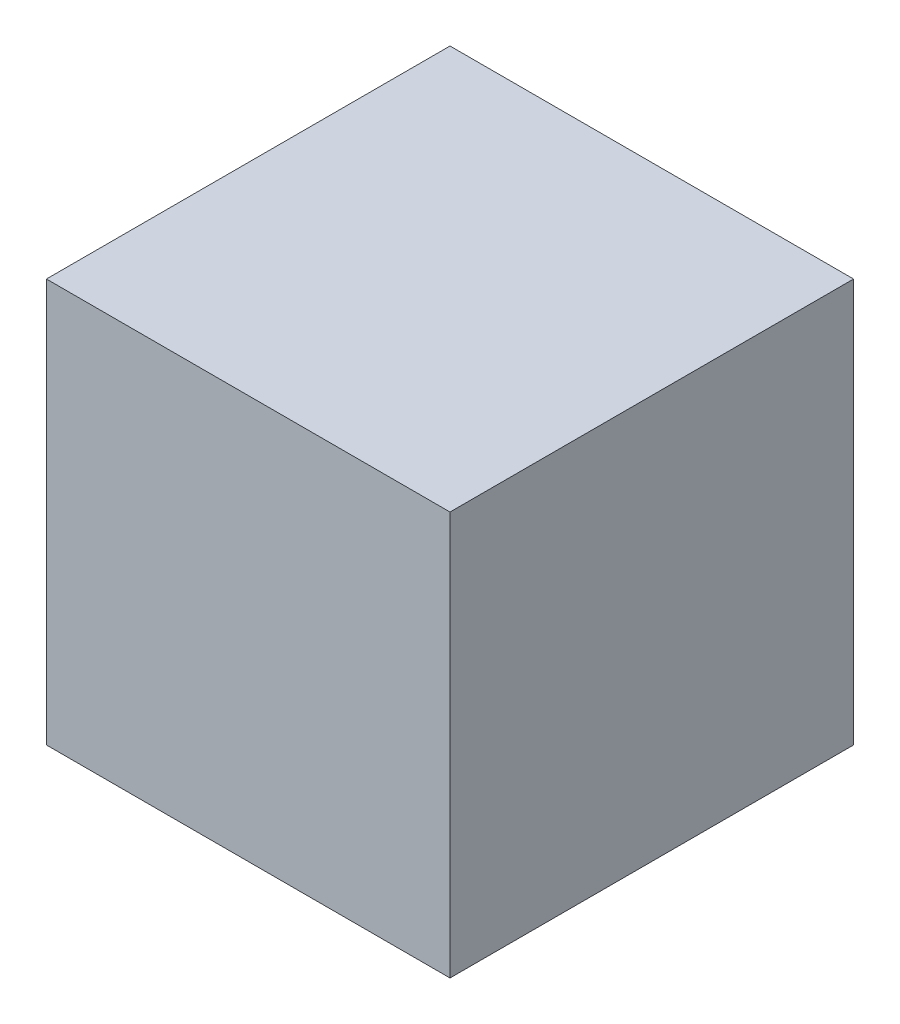
ISO-10303-21;
HEADER;
FILE_DESCRIPTION(('STEP AP214'),'2;1');
FILE_NAME('part.step','',(''),(''),'','','');
FILE_SCHEMA(('AUTOMOTIVE_DESIGN { 1 0 10303 214 1 1 1 1 }'));
ENDSEC;
DATA;
#1=APPLICATION_CONTEXT('core data for automotive mechanical design processes');
#2=APPLICATION_PROTOCOL_DEFINITION('international standard','automotive_design',2000,#1);
#3=PRODUCT_CONTEXT('',#1,'mechanical');
#4=PRODUCT('Part','Part','',(#3));
#5=PRODUCT_RELATED_PRODUCT_CATEGORY('part','',(#4));
#6=PRODUCT_DEFINITION_FORMATION('','',#4);
#7=PRODUCT_DEFINITION_CONTEXT('part definition',#1,'design');
#8=PRODUCT_DEFINITION('design','',#6,#7);
#9=PRODUCT_DEFINITION_SHAPE('','',#8);
#10=(LENGTH_UNIT() NAMED_UNIT(*) SI_UNIT(.MILLI.,.METRE.));
#11=(NAMED_UNIT(*) PLANE_ANGLE_UNIT() SI_UNIT($,.RADIAN.));
#12=(NAMED_UNIT(*) SI_UNIT($,.STERADIAN.) SOLID_ANGLE_UNIT());
#13=UNCERTAINTY_MEASURE_WITH_UNIT(LENGTH_MEASURE(1.E-05),#10,'distance_accuracy_value','');
#14=(GEOMETRIC_REPRESENTATION_CONTEXT(3) GLOBAL_UNCERTAINTY_ASSIGNED_CONTEXT((#13)) GLOBAL_UNIT_ASSIGNED_CONTEXT((#10,
#11,#12)) REPRESENTATION_CONTEXT('',''));
#15=CARTESIAN_POINT('',(0.,0.,0.));
#16=DIRECTION('',(0.,0.,1.));
#17=DIRECTION('',(1.,0.,0.));
#18=AXIS2_PLACEMENT_3D('',#15,#16,#17);
#19=CARTESIAN_POINT('',(-0.500000000000001,-0.500000000000001,0.));
#20=DIRECTION('',(0.,0.,1.));
#21=DIRECTION('',(1.,0.,0.));
#22=AXIS2_PLACEMENT_3D('',#19,#20,#21);
#23=PLANE('',#22);
#24=DIRECTION('',(1.,0.,0.));
#25=VECTOR('',#24,1.);
#26=CARTESIAN_POINT('',(-0.500000000000001,0.500000000000001,0.));
#27=LINE('',#26,#25);
#28=CARTESIAN_POINT('',(-0.500000000000001,0.500000000000001,0.));
#29=VERTEX_POINT('',#28);
#30=CARTESIAN_POINT('',(0.500000000000001,0.500000000000001,0.));
#31=VERTEX_POINT('',#30);
#32=EDGE_CURVE('E81',#29,#31,#27,.T.);
#33=ORIENTED_EDGE('',*,*,#32,.T.);
#34=DIRECTION('',(0.,1.,0.));
#35=VECTOR('',#34,1.);
#36=CARTESIAN_POINT('',(0.500000000000001,0.500000000000001,0.));
#37=LINE('',#36,#35);
#38=CARTESIAN_POINT('',(0.500000000000001,-0.500000000000001,0.));
#39=VERTEX_POINT('',#38);
#40=EDGE_CURVE('E68',#31,#39,#37,.F.);
#41=ORIENTED_EDGE('',*,*,#40,.T.);
#42=DIRECTION('',(1.,0.,0.));
#43=VECTOR('',#42,1.);
#44=CARTESIAN_POINT('',(-0.500000000000001,-0.500000000000001,0.));
#45=LINE('',#44,#43);
#46=CARTESIAN_POINT('',(-0.500000000000001,-0.500000000000001,0.));
#47=VERTEX_POINT('',#46);
#48=EDGE_CURVE('E55',#39,#47,#45,.F.);
#49=ORIENTED_EDGE('',*,*,#48,.T.);
#50=DIRECTION('',(0.,1.,0.));
#51=VECTOR('',#50,1.);
#52=CARTESIAN_POINT('',(-0.500000000000001,0.500000000000001,0.));
#53=LINE('',#52,#51);
#54=EDGE_CURVE('E20',#47,#29,#53,.T.);
#55=ORIENTED_EDGE('',*,*,#54,.T.);
#56=EDGE_LOOP('',(#33,#41,#49,#55));
#57=FACE_BOUND('',#56,.T.);
#58=ADVANCED_FACE('F17',(#57),#23,.F.);
#59=CARTESIAN_POINT('',(-0.500000000000001,0.500000000000001,1.));
#60=DIRECTION('',(1.,0.,0.));
#61=DIRECTION('',(0.,0.,-1.));
#62=AXIS2_PLACEMENT_3D('',#59,#60,#61);
#63=PLANE('',#62);
#64=DIRECTION('',(0.,0.,1.));
#65=VECTOR('',#64,1.);
#66=CARTESIAN_POINT('',(-0.500000000000001,-0.500000000000001,1.));
#67=LINE('',#66,#65);
#68=CARTESIAN_POINT('',(-0.500000000000001,-0.500000000000001,1.));
#69=VERTEX_POINT('',#68);
#70=EDGE_CURVE('E61',#47,#69,#67,.T.);
#71=ORIENTED_EDGE('',*,*,#70,.T.);
#72=DIRECTION('',(0.,1.,0.));
#73=VECTOR('',#72,1.);
#74=CARTESIAN_POINT('',(-0.500000000000001,-0.500000000000001,1.));
#75=LINE('',#74,#73);
#76=CARTESIAN_POINT('',(-0.500000000000001,0.500000000000001,1.));
#77=VERTEX_POINT('',#76);
#78=EDGE_CURVE('E83',#77,#69,#75,.F.);
#79=ORIENTED_EDGE('',*,*,#78,.F.);
#80=DIRECTION('',(0.,0.,-1.));
#81=VECTOR('',#80,1.);
#82=CARTESIAN_POINT('',(-0.500000000000001,0.500000000000001,1.));
#83=LINE('',#82,#81);
#84=EDGE_CURVE('E64',#77,#29,#83,.T.);
#85=ORIENTED_EDGE('',*,*,#84,.T.);
#86=ORIENTED_EDGE('',*,*,#54,.F.);
#87=EDGE_LOOP('',(#71,#79,#85,#86));
#88=FACE_BOUND('',#87,.T.);
#89=ADVANCED_FACE('F60',(#88),#63,.F.);
#90=CARTESIAN_POINT('',(-0.500000000000001,-0.500000000000001,1.));
#91=DIRECTION('',(0.,1.,0.));
#92=DIRECTION('',(0.,0.,1.));
#93=AXIS2_PLACEMENT_3D('',#90,#91,#92);
#94=PLANE('',#93);
#95=DIRECTION('',(0.,0.,1.));
#96=VECTOR('',#95,1.);
#97=CARTESIAN_POINT('',(0.500000000000001,-0.500000000000001,1.));
#98=LINE('',#97,#96);
#99=CARTESIAN_POINT('',(0.500000000000001,-0.500000000000001,1.));
#100=VERTEX_POINT('',#99);
#101=EDGE_CURVE('E70',#39,#100,#98,.T.);
#102=ORIENTED_EDGE('',*,*,#101,.T.);
#103=DIRECTION('',(1.,0.,0.));
#104=VECTOR('',#103,1.);
#105=CARTESIAN_POINT('',(-0.500000000000001,-0.500000000000001,1.));
#106=LINE('',#105,#104);
#107=EDGE_CURVE('E74',#69,#100,#106,.T.);
#108=ORIENTED_EDGE('',*,*,#107,.F.);
#109=ORIENTED_EDGE('',*,*,#70,.F.);
#110=ORIENTED_EDGE('',*,*,#48,.F.);
#111=EDGE_LOOP('',(#102,#108,#109,#110));
#112=FACE_BOUND('',#111,.T.);
#113=ADVANCED_FACE('F72',(#112),#94,.F.);
#114=CARTESIAN_POINT('',(0.500000000000001,0.500000000000001,1.));
#115=DIRECTION('',(-1.,0.,0.));
#116=DIRECTION('',(0.,0.,1.));
#117=AXIS2_PLACEMENT_3D('',#114,#115,#116);
#118=PLANE('',#117);
#119=DIRECTION('',(0.,0.,-1.));
#120=VECTOR('',#119,1.);
#121=CARTESIAN_POINT('',(0.500000000000001,0.500000000000001,1.));
#122=LINE('',#121,#120);
#123=CARTESIAN_POINT('',(0.500000000000001,0.500000000000001,1.));
#124=VERTEX_POINT('',#123);
#125=EDGE_CURVE('E35',#31,#124,#122,.F.);
#126=ORIENTED_EDGE('',*,*,#125,.T.);
#127=DIRECTION('',(0.,1.,0.));
#128=VECTOR('',#127,1.);
#129=CARTESIAN_POINT('',(0.500000000000001,-0.500000000000001,1.));
#130=LINE('',#129,#128);
#131=EDGE_CURVE('E26',#100,#124,#130,.T.);
#132=ORIENTED_EDGE('',*,*,#131,.F.);
#133=ORIENTED_EDGE('',*,*,#101,.F.);
#134=ORIENTED_EDGE('',*,*,#40,.F.);
#135=EDGE_LOOP('',(#126,#132,#133,#134));
#136=FACE_BOUND('',#135,.T.);
#137=ADVANCED_FACE('F89',(#136),#118,.F.);
#138=CARTESIAN_POINT('',(-0.500000000000001,0.500000000000001,1.));
#139=DIRECTION('',(0.,-1.,0.));
#140=DIRECTION('',(0.,0.,-1.));
#141=AXIS2_PLACEMENT_3D('',#138,#139,#140);
#142=PLANE('',#141);
#143=ORIENTED_EDGE('',*,*,#84,.F.);
#144=DIRECTION('',(1.,0.,0.));
#145=VECTOR('',#144,1.);
#146=CARTESIAN_POINT('',(-0.500000000000001,0.500000000000001,1.));
#147=LINE('',#146,#145);
#148=EDGE_CURVE('E11',#124,#77,#147,.F.);
#149=ORIENTED_EDGE('',*,*,#148,.F.);
#150=ORIENTED_EDGE('',*,*,#125,.F.);
#151=ORIENTED_EDGE('',*,*,#32,.F.);
#152=EDGE_LOOP('',(#143,#149,#150,#151));
#153=FACE_BOUND('',#152,.T.);
#154=ADVANCED_FACE('F91',(#153),#142,.F.);
#155=CARTESIAN_POINT('',(-0.500000000000001,-0.500000000000001,1.));
#156=DIRECTION('',(0.,0.,1.));
#157=DIRECTION('',(1.,0.,0.));
#158=AXIS2_PLACEMENT_3D('',#155,#156,#157);
#159=PLANE('',#158);
#160=ORIENTED_EDGE('',*,*,#131,.T.);
#161=ORIENTED_EDGE('',*,*,#148,.T.);
#162=ORIENTED_EDGE('',*,*,#78,.T.);
#163=ORIENTED_EDGE('',*,*,#107,.T.);
#164=EDGE_LOOP('',(#160,#161,#162,#163));
#165=FACE_BOUND('',#164,.T.);
#166=ADVANCED_FACE('F88',(#165),#159,.T.);
#167=CLOSED_SHELL('',(#58,#89,#113,#137,#154,#166));
#168=MANIFOLD_SOLID_BREP('B1',#167);
#169=ADVANCED_BREP_SHAPE_REPRESENTATION('',(#18,#168),#14);
#170=SHAPE_DEFINITION_REPRESENTATION(#9,#169);
ENDSEC;
END-ISO-10303-21;
